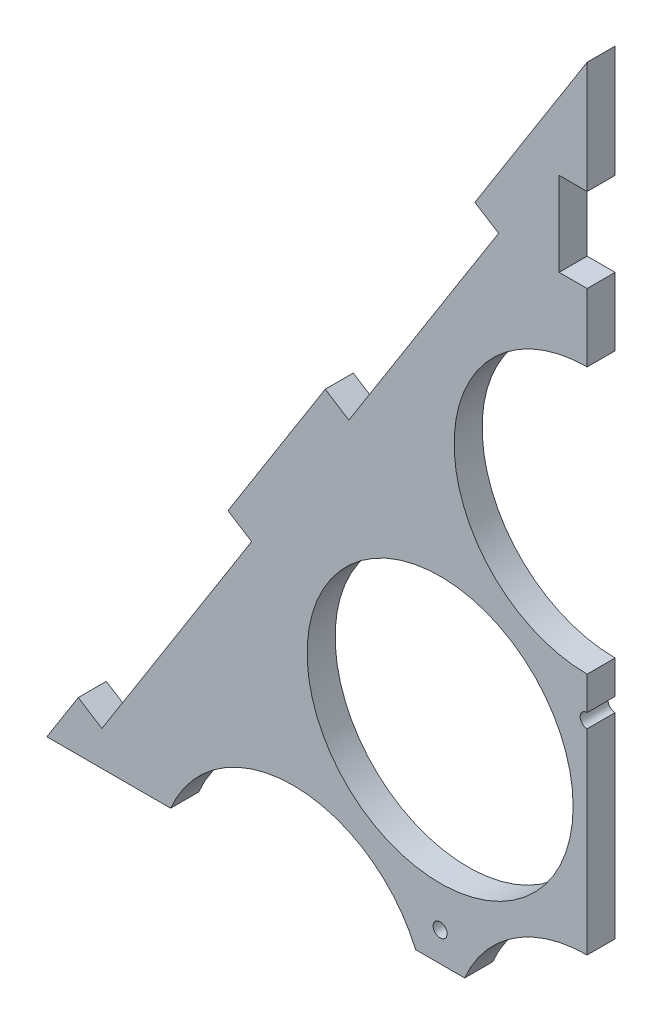
ISO-10303-21;
HEADER;
FILE_DESCRIPTION(('STEP AP214'),'2;1');
FILE_NAME('part.step','',(''),(''),'','','');
FILE_SCHEMA(('AUTOMOTIVE_DESIGN { 1 0 10303 214 1 1 1 1 }'));
ENDSEC;
DATA;
#1=APPLICATION_CONTEXT('core data for automotive mechanical design processes');
#2=APPLICATION_PROTOCOL_DEFINITION('international standard','automotive_design',2000,#1);
#3=PRODUCT_CONTEXT('',#1,'mechanical');
#4=PRODUCT('Part','Part','',(#3));
#5=PRODUCT_RELATED_PRODUCT_CATEGORY('part','',(#4));
#6=PRODUCT_DEFINITION_FORMATION('','',#4);
#7=PRODUCT_DEFINITION_CONTEXT('part definition',#1,'design');
#8=PRODUCT_DEFINITION('design','',#6,#7);
#9=PRODUCT_DEFINITION_SHAPE('','',#8);
#10=(LENGTH_UNIT() NAMED_UNIT(*) SI_UNIT(.MILLI.,.METRE.));
#11=(NAMED_UNIT(*) PLANE_ANGLE_UNIT() SI_UNIT($,.RADIAN.));
#12=(NAMED_UNIT(*) SI_UNIT($,.STERADIAN.) SOLID_ANGLE_UNIT());
#13=UNCERTAINTY_MEASURE_WITH_UNIT(LENGTH_MEASURE(1.E-05),#10,'distance_accuracy_value','');
#14=(GEOMETRIC_REPRESENTATION_CONTEXT(3) GLOBAL_UNCERTAINTY_ASSIGNED_CONTEXT((#13)) GLOBAL_UNIT_ASSIGNED_CONTEXT((#10,
#11,#12)) REPRESENTATION_CONTEXT('',''));
#15=CARTESIAN_POINT('',(0.,0.,0.));
#16=DIRECTION('',(0.,0.,1.));
#17=DIRECTION('',(1.,0.,0.));
#18=AXIS2_PLACEMENT_3D('',#15,#16,#17);
#19=CARTESIAN_POINT('',(0.,414.561180134828,0.));
#20=DIRECTION('',(-1.,0.,0.));
#21=DIRECTION('',(0.,-1.,0.));
#22=AXIS2_PLACEMENT_3D('',#19,#20,#21);
#23=PLANE('',#22);
#24=DIRECTION('',(0.,-1.,0.));
#25=VECTOR('',#24,1.);
#26=CARTESIAN_POINT('',(0.,414.561180134828,0.));
#27=LINE('',#26,#25);
#28=CARTESIAN_POINT('',(0.,344.561180134828,0.));
#29=VERTEX_POINT('',#28);
#30=CARTESIAN_POINT('',(0.,320.298002192098,0.));
#31=VERTEX_POINT('',#30);
#32=EDGE_CURVE('E220',#29,#31,#27,.T.);
#33=ORIENTED_EDGE('',*,*,#32,.F.);
#34=DIRECTION('',(0.,0.,1.));
#35=VECTOR('',#34,1.);
#36=CARTESIAN_POINT('',(0.,344.561180134828,0.));
#37=LINE('',#36,#35);
#38=CARTESIAN_POINT('',(0.,344.561180134828,10.));
#39=VERTEX_POINT('',#38);
#40=EDGE_CURVE('E213',#29,#39,#37,.T.);
#41=ORIENTED_EDGE('',*,*,#40,.T.);
#42=DIRECTION('',(0.,-1.,0.));
#43=VECTOR('',#42,1.);
#44=CARTESIAN_POINT('',(0.,414.561180134828,10.));
#45=LINE('',#44,#43);
#46=CARTESIAN_POINT('',(0.,320.298002192098,10.));
#47=VERTEX_POINT('',#46);
#48=EDGE_CURVE('E228',#39,#47,#45,.T.);
#49=ORIENTED_EDGE('',*,*,#48,.T.);
#50=DIRECTION('',(0.,0.,-1.));
#51=VECTOR('',#50,1.);
#52=CARTESIAN_POINT('',(0.,320.298002192098,10.));
#53=LINE('',#52,#51);
#54=EDGE_CURVE('E234',#47,#31,#53,.T.);
#55=ORIENTED_EDGE('',*,*,#54,.T.);
#56=EDGE_LOOP('',(#33,#41,#49,#55));
#57=FACE_BOUND('',#56,.T.);
#58=ADVANCED_FACE('F35',(#57),#23,.F.);
#59=CARTESIAN_POINT('',(-310.,-75.6428590162172,10.));
#60=DIRECTION('',(0.845179377846631,-0.53448275862069,0.));
#61=DIRECTION('',(0.53448275862069,0.845179377846631,0.));
#62=AXIS2_PLACEMENT_3D('',#59,#60,#61);
#63=PLANE('',#62);
#64=DIRECTION('',(-0.53448275862069,-0.845179377846631,0.));
#65=VECTOR('',#64,1.);
#66=CARTESIAN_POINT('',(-310.,-75.6428590162172,0.));
#67=LINE('',#66,#65);
#68=CARTESIAN_POINT('',(-181.724137931035,127.200191666973,0.));
#69=VERTEX_POINT('',#68);
#70=CARTESIAN_POINT('',(-192.942106645631,109.461180134828,0.));
#71=VERTEX_POINT('',#70);
#72=EDGE_CURVE('E332',#69,#71,#67,.T.);
#73=ORIENTED_EDGE('',*,*,#72,.T.);
#74=DIRECTION('',(0.,0.,1.));
#75=VECTOR('',#74,1.);
#76=CARTESIAN_POINT('',(-192.942106645631,109.461180134828,10.));
#77=LINE('',#76,#75);
#78=CARTESIAN_POINT('',(-192.942106645631,109.461180134828,10.));
#79=VERTEX_POINT('',#78);
#80=EDGE_CURVE('E243',#71,#79,#77,.T.);
#81=ORIENTED_EDGE('',*,*,#80,.T.);
#82=DIRECTION('',(-0.53448275862069,-0.845179377846631,0.));
#83=VECTOR('',#82,1.);
#84=CARTESIAN_POINT('',(-310.,-75.6428590162172,10.));
#85=LINE('',#84,#83);
#86=CARTESIAN_POINT('',(-181.724137931035,127.200191666974,10.));
#87=VERTEX_POINT('',#86);
#88=EDGE_CURVE('E340',#87,#79,#85,.T.);
#89=ORIENTED_EDGE('',*,*,#88,.F.);
#90=DIRECTION('',(0.,0.,1.));
#91=VECTOR('',#90,1.);
#92=CARTESIAN_POINT('',(-181.724137931035,127.200191666974,0.));
#93=LINE('',#92,#91);
#94=EDGE_CURVE('E269',#69,#87,#93,.T.);
#95=ORIENTED_EDGE('',*,*,#94,.F.);
#96=EDGE_LOOP('',(#73,#81,#89,#95));
#97=FACE_BOUND('',#96,.T.);
#98=ADVANCED_FACE('F37',(#97),#63,.F.);
#99=CARTESIAN_POINT('',(-93.5344827586213,266.654789011667,0.));
#100=VERTEX_POINT('',#99);
#101=CARTESIAN_POINT('',(-128.275862068965,211.718129451637,0.));
#102=VERTEX_POINT('',#101);
#103=EDGE_CURVE('E344',#100,#102,#67,.T.);
#104=ORIENTED_EDGE('',*,*,#103,.T.);
#105=DIRECTION('',(0.,0.,1.));
#106=VECTOR('',#105,1.);
#107=CARTESIAN_POINT('',(-128.275862068965,211.718129451637,0.));
#108=LINE('',#107,#106);
#109=CARTESIAN_POINT('',(-128.275862068965,211.718129451637,10.));
#110=VERTEX_POINT('',#109);
#111=EDGE_CURVE('E278',#102,#110,#108,.T.);
#112=ORIENTED_EDGE('',*,*,#111,.T.);
#113=CARTESIAN_POINT('',(-93.5344827586214,266.654789011669,10.));
#114=VERTEX_POINT('',#113);
#115=EDGE_CURVE('E339',#114,#110,#85,.T.);
#116=ORIENTED_EDGE('',*,*,#115,.F.);
#117=DIRECTION('',(0.,0.,1.));
#118=VECTOR('',#117,1.);
#119=CARTESIAN_POINT('',(-93.5344827586214,266.654789011669,0.));
#120=LINE('',#119,#118);
#121=EDGE_CURVE('E297',#100,#114,#120,.T.);
#122=ORIENTED_EDGE('',*,*,#121,.F.);
#123=EDGE_LOOP('',(#104,#112,#116,#122));
#124=FACE_BOUND('',#123,.T.);
#125=ADVANCED_FACE('F391',(#124),#63,.F.);
#126=CARTESIAN_POINT('',(0.,414.561180134828,0.));
#127=VERTEX_POINT('',#126);
#128=CARTESIAN_POINT('',(-40.0862068965517,351.172726796331,0.));
#129=VERTEX_POINT('',#128);
#130=EDGE_CURVE('E341',#127,#129,#67,.T.);
#131=ORIENTED_EDGE('',*,*,#130,.T.);
#132=DIRECTION('',(0.,0.,1.));
#133=VECTOR('',#132,1.);
#134=CARTESIAN_POINT('',(-40.0862068965517,351.172726796331,0.));
#135=LINE('',#134,#133);
#136=CARTESIAN_POINT('',(-40.0862068965517,351.172726796331,10.));
#137=VERTEX_POINT('',#136);
#138=EDGE_CURVE('E274',#129,#137,#135,.T.);
#139=ORIENTED_EDGE('',*,*,#138,.T.);
#140=CARTESIAN_POINT('',(0.,414.561180134828,10.));
#141=VERTEX_POINT('',#140);
#142=EDGE_CURVE('E335',#141,#137,#85,.T.);
#143=ORIENTED_EDGE('',*,*,#142,.F.);
#144=DIRECTION('',(0.,0.,-1.));
#145=VECTOR('',#144,1.);
#146=CARTESIAN_POINT('',(0.,414.561180134828,10.));
#147=LINE('',#146,#145);
#148=EDGE_CURVE('E338',#141,#127,#147,.T.);
#149=ORIENTED_EDGE('',*,*,#148,.T.);
#150=EDGE_LOOP('',(#131,#139,#143,#149));
#151=FACE_BOUND('',#150,.T.);
#152=ADVANCED_FACE('F411',(#151),#63,.F.);
#153=CARTESIAN_POINT('',(0.,0.,10.));
#154=DIRECTION('',(0.,0.,-1.));
#155=DIRECTION('',(-1.,0.,0.));
#156=AXIS2_PLACEMENT_3D('',#153,#154,#155);
#157=PLANE('',#156);
#158=CARTESIAN_POINT('',(-52.5,119.980042493922,10.));
#159=DIRECTION('',(0.,0.,1.));
#160=DIRECTION('',(1.,0.,0.));
#161=AXIS2_PLACEMENT_3D('',#158,#159,#160);
#162=CIRCLE('',#161,2.5);
#163=CARTESIAN_POINT('',(-50.,119.980042493922,10.));
#164=VERTEX_POINT('',#163);
#165=EDGE_CURVE('E250',#164,#164,#162,.T.);
#166=ORIENTED_EDGE('',*,*,#165,.F.);
#167=EDGE_LOOP('',(#166));
#168=FACE_BOUND('',#167,.T.);
#169=ORIENTED_EDGE('',*,*,#48,.F.);
#170=DIRECTION('',(1.,0.,0.));
#171=VECTOR('',#170,1.);
#172=CARTESIAN_POINT('',(0.,344.561180134828,10.));
#173=LINE('',#172,#171);
#174=CARTESIAN_POINT('',(-10.,344.561180134828,10.));
#175=VERTEX_POINT('',#174);
#176=EDGE_CURVE('E205',#175,#39,#173,.T.);
#177=ORIENTED_EDGE('',*,*,#176,.F.);
#178=DIRECTION('',(0.,-1.,0.));
#179=VECTOR('',#178,1.);
#180=CARTESIAN_POINT('',(-10.,374.561180134828,10.));
#181=LINE('',#180,#179);
#182=CARTESIAN_POINT('',(-10.,374.561180134828,10.));
#183=VERTEX_POINT('',#182);
#184=EDGE_CURVE('E207',#183,#175,#181,.T.);
#185=ORIENTED_EDGE('',*,*,#184,.F.);
#186=DIRECTION('',(-1.,0.,0.));
#187=VECTOR('',#186,1.);
#188=CARTESIAN_POINT('',(0.,374.561180134828,10.));
#189=LINE('',#188,#187);
#190=CARTESIAN_POINT('',(0.,374.561180134828,10.));
#191=VERTEX_POINT('',#190);
#192=EDGE_CURVE('E185',#191,#183,#189,.T.);
#193=ORIENTED_EDGE('',*,*,#192,.F.);
#194=EDGE_CURVE('E224',#141,#191,#45,.T.);
#195=ORIENTED_EDGE('',*,*,#194,.F.);
#196=ORIENTED_EDGE('',*,*,#142,.T.);
#197=DIRECTION('',(-0.84517937784663,0.534482758620691,0.));
#198=VECTOR('',#197,1.);
#199=CARTESIAN_POINT('',(-31.6344131180852,345.827899210124,10.));
#200=LINE('',#199,#198);
#201=CARTESIAN_POINT('',(-31.6344131180852,345.827899210124,10.));
#202=VERTEX_POINT('',#201);
#203=EDGE_CURVE('E291',#202,#137,#200,.T.);
#204=ORIENTED_EDGE('',*,*,#203,.F.);
#205=DIRECTION('',(0.53448275862069,0.845179377846631,0.));
#206=VECTOR('',#205,1.);
#207=CARTESIAN_POINT('',(-85.0826889801541,261.309961425461,10.));
#208=LINE('',#207,#206);
#209=CARTESIAN_POINT('',(-85.0826889801541,261.309961425461,10.));
#210=VERTEX_POINT('',#209);
#211=EDGE_CURVE('E300',#210,#202,#208,.T.);
#212=ORIENTED_EDGE('',*,*,#211,.F.);
#213=DIRECTION('',(0.84517937784663,-0.534482758620691,0.));
#214=VECTOR('',#213,1.);
#215=CARTESIAN_POINT('',(-93.5344827586214,266.654789011669,10.));
#216=LINE('',#215,#214);
#217=EDGE_CURVE('E256',#114,#210,#216,.T.);
#218=ORIENTED_EDGE('',*,*,#217,.F.);
#219=ORIENTED_EDGE('',*,*,#115,.T.);
#220=DIRECTION('',(-0.84517937784663,0.53448275862069,0.));
#221=VECTOR('',#220,1.);
#222=CARTESIAN_POINT('',(-119.8240682905,206.37330186543,10.));
#223=LINE('',#222,#221);
#224=CARTESIAN_POINT('',(-119.8240682905,206.37330186543,10.));
#225=VERTEX_POINT('',#224);
#226=EDGE_CURVE('E263',#225,#110,#223,.T.);
#227=ORIENTED_EDGE('',*,*,#226,.F.);
#228=DIRECTION('',(0.534482758620691,0.845179377846629,0.));
#229=VECTOR('',#228,1.);
#230=CARTESIAN_POINT('',(-173.272344152569,121.855364080768,10.));
#231=LINE('',#230,#229);
#232=CARTESIAN_POINT('',(-173.272344152569,121.855364080768,10.));
#233=VERTEX_POINT('',#232);
#234=EDGE_CURVE('E273',#233,#225,#231,.T.);
#235=ORIENTED_EDGE('',*,*,#234,.F.);
#236=DIRECTION('',(0.84517937784663,-0.534482758620691,0.));
#237=VECTOR('',#236,1.);
#238=CARTESIAN_POINT('',(-181.724137931035,127.200191666974,10.));
#239=LINE('',#238,#237);
#240=EDGE_CURVE('E270',#87,#233,#239,.T.);
#241=ORIENTED_EDGE('',*,*,#240,.F.);
#242=ORIENTED_EDGE('',*,*,#88,.T.);
#243=DIRECTION('',(-1.,0.,0.));
#244=VECTOR('',#243,1.);
#245=CARTESIAN_POINT('',(0.,109.461180134828,10.));
#246=LINE('',#245,#244);
#247=CARTESIAN_POINT('',(-148.737217741161,109.461180134828,10.));
#248=VERTEX_POINT('',#247);
#249=EDGE_CURVE('E227',#248,#79,#246,.T.);
#250=ORIENTED_EDGE('',*,*,#249,.F.);
#251=CARTESIAN_POINT('',(-105.,90.932667397366,10.));
#252=DIRECTION('',(0.,0.,1.));
#253=DIRECTION('',(1.,0.,0.));
#254=AXIS2_PLACEMENT_3D('',#251,#252,#253);
#255=CIRCLE('',#254,47.5);
#256=CARTESIAN_POINT('',(-61.2627822588393,109.461180134828,10.));
#257=VERTEX_POINT('',#256);
#258=EDGE_CURVE('E329',#257,#248,#255,.T.);
#259=ORIENTED_EDGE('',*,*,#258,.F.);
#260=CARTESIAN_POINT('',(-43.7372177411607,109.461180134828,10.));
#261=VERTEX_POINT('',#260);
#262=EDGE_CURVE('E231',#261,#257,#246,.T.);
#263=ORIENTED_EDGE('',*,*,#262,.F.);
#264=CARTESIAN_POINT('',(0.,90.932667397366,10.));
#265=DIRECTION('',(0.,0.,1.));
#266=DIRECTION('',(1.,0.,0.));
#267=AXIS2_PLACEMENT_3D('',#264,#265,#266);
#268=CIRCLE('',#267,47.5);
#269=CARTESIAN_POINT('',(0.,138.432667397366,10.));
#270=VERTEX_POINT('',#269);
#271=EDGE_CURVE('E323',#270,#261,#268,.T.);
#272=ORIENTED_EDGE('',*,*,#271,.F.);
#273=CARTESIAN_POINT('',(0.,208.412709891288,10.));
#274=VERTEX_POINT('',#273);
#275=EDGE_CURVE('E216',#274,#270,#45,.T.);
#276=ORIENTED_EDGE('',*,*,#275,.F.);
#277=CARTESIAN_POINT('',(0.,210.912709891288,10.));
#278=DIRECTION('',(0.,0.,1.));
#279=DIRECTION('',(1.,0.,0.));
#280=AXIS2_PLACEMENT_3D('',#277,#278,#279);
#281=CIRCLE('',#280,2.5);
#282=CARTESIAN_POINT('',(0.,213.412709891288,10.));
#283=VERTEX_POINT('',#282);
#284=EDGE_CURVE('E246',#283,#274,#281,.T.);
#285=ORIENTED_EDGE('',*,*,#284,.F.);
#286=CARTESIAN_POINT('',(0.,225.298002192098,10.));
#287=VERTEX_POINT('',#286);
#288=EDGE_CURVE('E229',#287,#283,#45,.T.);
#289=ORIENTED_EDGE('',*,*,#288,.F.);
#290=CARTESIAN_POINT('',(0.,272.798002192098,10.));
#291=DIRECTION('',(0.,0.,1.));
#292=DIRECTION('',(1.,0.,0.));
#293=AXIS2_PLACEMENT_3D('',#290,#291,#292);
#294=CIRCLE('',#293,47.5);
#295=EDGE_CURVE('E311',#47,#287,#294,.T.);
#296=ORIENTED_EDGE('',*,*,#295,.F.);
#297=EDGE_LOOP('',(#169,#177,#185,#193,#195,#196,#204,#212,#218,#219,#227,#235,#241,#242,#250,
#259,#263,#272,#276,#285,#289,#296));
#298=FACE_BOUND('',#297,.T.);
#299=CARTESIAN_POINT('',(-52.5,181.865334794732,10.));
#300=DIRECTION('',(0.,0.,1.));
#301=DIRECTION('',(1.,0.,0.));
#302=AXIS2_PLACEMENT_3D('',#299,#300,#301);
#303=CIRCLE('',#302,47.5);
#304=CARTESIAN_POINT('',(-4.99999999999998,181.865334794732,10.));
#305=VERTEX_POINT('',#304);
#306=EDGE_CURVE('E317',#305,#305,#303,.T.);
#307=ORIENTED_EDGE('',*,*,#306,.F.);
#308=EDGE_LOOP('',(#307));
#309=FACE_BOUND('',#308,.T.);
#310=ADVANCED_FACE('F377',(#168,#298,#309),#157,.F.);
#311=CARTESIAN_POINT('',(0.,0.,0.));
#312=DIRECTION('',(0.,0.,-1.));
#313=DIRECTION('',(-1.,0.,0.));
#314=AXIS2_PLACEMENT_3D('',#311,#312,#313);
#315=PLANE('',#314);
#316=DIRECTION('',(1.,0.,0.));
#317=VECTOR('',#316,1.);
#318=CARTESIAN_POINT('',(0.,344.561180134828,0.));
#319=LINE('',#318,#317);
#320=CARTESIAN_POINT('',(-10.,344.561180134828,0.));
#321=VERTEX_POINT('',#320);
#322=EDGE_CURVE('E198',#321,#29,#319,.T.);
#323=ORIENTED_EDGE('',*,*,#322,.T.);
#324=ORIENTED_EDGE('',*,*,#32,.T.);
#325=CARTESIAN_POINT('',(0.,272.798002192098,0.));
#326=DIRECTION('',(0.,0.,1.));
#327=DIRECTION('',(1.,0.,0.));
#328=AXIS2_PLACEMENT_3D('',#325,#326,#327);
#329=CIRCLE('',#328,47.5);
#330=CARTESIAN_POINT('',(0.,225.298002192098,0.));
#331=VERTEX_POINT('',#330);
#332=EDGE_CURVE('E281',#31,#331,#329,.T.);
#333=ORIENTED_EDGE('',*,*,#332,.T.);
#334=CARTESIAN_POINT('',(0.,213.412709891288,0.));
#335=VERTEX_POINT('',#334);
#336=EDGE_CURVE('E221',#331,#335,#27,.T.);
#337=ORIENTED_EDGE('',*,*,#336,.T.);
#338=CARTESIAN_POINT('',(0.,210.912709891288,0.));
#339=DIRECTION('',(0.,0.,1.));
#340=DIRECTION('',(1.,0.,0.));
#341=AXIS2_PLACEMENT_3D('',#338,#339,#340);
#342=CIRCLE('',#341,2.5);
#343=CARTESIAN_POINT('',(0.,208.412709891288,0.));
#344=VERTEX_POINT('',#343);
#345=EDGE_CURVE('E247',#335,#344,#342,.T.);
#346=ORIENTED_EDGE('',*,*,#345,.T.);
#347=CARTESIAN_POINT('',(0.,138.432667397366,0.));
#348=VERTEX_POINT('',#347);
#349=EDGE_CURVE('E358',#344,#348,#27,.T.);
#350=ORIENTED_EDGE('',*,*,#349,.T.);
#351=CARTESIAN_POINT('',(0.,90.932667397366,0.));
#352=DIRECTION('',(0.,0.,1.));
#353=DIRECTION('',(1.,0.,0.));
#354=AXIS2_PLACEMENT_3D('',#351,#352,#353);
#355=CIRCLE('',#354,47.5);
#356=CARTESIAN_POINT('',(-43.7372177411607,109.461180134828,0.));
#357=VERTEX_POINT('',#356);
#358=EDGE_CURVE('E320',#348,#357,#355,.T.);
#359=ORIENTED_EDGE('',*,*,#358,.T.);
#360=DIRECTION('',(-1.,0.,0.));
#361=VECTOR('',#360,1.);
#362=CARTESIAN_POINT('',(0.,109.461180134828,0.));
#363=LINE('',#362,#361);
#364=CARTESIAN_POINT('',(-61.2627822588393,109.461180134828,0.));
#365=VERTEX_POINT('',#364);
#366=EDGE_CURVE('E223',#357,#365,#363,.T.);
#367=ORIENTED_EDGE('',*,*,#366,.T.);
#368=CARTESIAN_POINT('',(-105.,90.932667397366,0.));
#369=DIRECTION('',(0.,0.,1.));
#370=DIRECTION('',(1.,0.,0.));
#371=AXIS2_PLACEMENT_3D('',#368,#369,#370);
#372=CIRCLE('',#371,47.5);
#373=CARTESIAN_POINT('',(-148.737217741161,109.461180134828,0.));
#374=VERTEX_POINT('',#373);
#375=EDGE_CURVE('E326',#365,#374,#372,.T.);
#376=ORIENTED_EDGE('',*,*,#375,.T.);
#377=EDGE_CURVE('E58',#374,#71,#363,.T.);
#378=ORIENTED_EDGE('',*,*,#377,.T.);
#379=ORIENTED_EDGE('',*,*,#72,.F.);
#380=DIRECTION('',(0.84517937784663,-0.534482758620691,0.));
#381=VECTOR('',#380,1.);
#382=CARTESIAN_POINT('',(-181.724137931035,127.200191666974,0.));
#383=LINE('',#382,#381);
#384=CARTESIAN_POINT('',(-173.272344152569,121.855364080768,0.));
#385=VERTEX_POINT('',#384);
#386=EDGE_CURVE('E259',#69,#385,#383,.T.);
#387=ORIENTED_EDGE('',*,*,#386,.T.);
#388=DIRECTION('',(0.534482758620691,0.845179377846629,0.));
#389=VECTOR('',#388,1.);
#390=CARTESIAN_POINT('',(-173.272344152569,121.855364080768,0.));
#391=LINE('',#390,#389);
#392=CARTESIAN_POINT('',(-119.8240682905,206.37330186543,0.));
#393=VERTEX_POINT('',#392);
#394=EDGE_CURVE('E262',#385,#393,#391,.T.);
#395=ORIENTED_EDGE('',*,*,#394,.T.);
#396=DIRECTION('',(-0.84517937784663,0.53448275862069,0.));
#397=VECTOR('',#396,1.);
#398=CARTESIAN_POINT('',(-119.8240682905,206.37330186543,0.));
#399=LINE('',#398,#397);
#400=EDGE_CURVE('E266',#393,#102,#399,.T.);
#401=ORIENTED_EDGE('',*,*,#400,.T.);
#402=ORIENTED_EDGE('',*,*,#103,.F.);
#403=DIRECTION('',(0.84517937784663,-0.534482758620691,0.));
#404=VECTOR('',#403,1.);
#405=CARTESIAN_POINT('',(-93.5344827586214,266.654789011669,0.));
#406=LINE('',#405,#404);
#407=CARTESIAN_POINT('',(-85.0826889801541,261.309961425461,0.));
#408=VERTEX_POINT('',#407);
#409=EDGE_CURVE('E287',#100,#408,#406,.T.);
#410=ORIENTED_EDGE('',*,*,#409,.T.);
#411=DIRECTION('',(0.53448275862069,0.845179377846631,0.));
#412=VECTOR('',#411,1.);
#413=CARTESIAN_POINT('',(-85.0826889801541,261.309961425461,0.));
#414=LINE('',#413,#412);
#415=CARTESIAN_POINT('',(-31.6344131180852,345.827899210124,0.));
#416=VERTEX_POINT('',#415);
#417=EDGE_CURVE('E290',#408,#416,#414,.T.);
#418=ORIENTED_EDGE('',*,*,#417,.T.);
#419=DIRECTION('',(-0.84517937784663,0.534482758620691,0.));
#420=VECTOR('',#419,1.);
#421=CARTESIAN_POINT('',(-31.6344131180852,345.827899210124,0.));
#422=LINE('',#421,#420);
#423=EDGE_CURVE('E294',#416,#129,#422,.T.);
#424=ORIENTED_EDGE('',*,*,#423,.T.);
#425=ORIENTED_EDGE('',*,*,#130,.F.);
#426=CARTESIAN_POINT('',(0.,374.561180134828,0.));
#427=VERTEX_POINT('',#426);
#428=EDGE_CURVE('E204',#127,#427,#27,.T.);
#429=ORIENTED_EDGE('',*,*,#428,.T.);
#430=DIRECTION('',(-1.,0.,0.));
#431=VECTOR('',#430,1.);
#432=CARTESIAN_POINT('',(0.,374.561180134828,0.));
#433=LINE('',#432,#431);
#434=CARTESIAN_POINT('',(-10.,374.561180134828,0.));
#435=VERTEX_POINT('',#434);
#436=EDGE_CURVE('E50',#427,#435,#433,.T.);
#437=ORIENTED_EDGE('',*,*,#436,.T.);
#438=DIRECTION('',(0.,-1.,0.));
#439=VECTOR('',#438,1.);
#440=CARTESIAN_POINT('',(-10.,374.561180134828,0.));
#441=LINE('',#440,#439);
#442=EDGE_CURVE('E193',#435,#321,#441,.T.);
#443=ORIENTED_EDGE('',*,*,#442,.T.);
#444=EDGE_LOOP('',(#323,#324,#333,#337,#346,#350,#359,#367,#376,#378,#379,#387,#395,#401,#402,
#410,#418,#424,#425,#429,#437,#443));
#445=FACE_BOUND('',#444,.T.);
#446=CARTESIAN_POINT('',(-52.5,119.980042493922,0.));
#447=DIRECTION('',(0.,0.,1.));
#448=DIRECTION('',(1.,0.,0.));
#449=AXIS2_PLACEMENT_3D('',#446,#447,#448);
#450=CIRCLE('',#449,2.5);
#451=CARTESIAN_POINT('',(-50.,119.980042493922,0.));
#452=VERTEX_POINT('',#451);
#453=EDGE_CURVE('E253',#452,#452,#450,.T.);
#454=ORIENTED_EDGE('',*,*,#453,.T.);
#455=EDGE_LOOP('',(#454));
#456=FACE_BOUND('',#455,.T.);
#457=CARTESIAN_POINT('',(-52.5,181.865334794732,0.));
#458=DIRECTION('',(0.,0.,1.));
#459=DIRECTION('',(1.,0.,0.));
#460=AXIS2_PLACEMENT_3D('',#457,#458,#459);
#461=CIRCLE('',#460,47.5);
#462=CARTESIAN_POINT('',(-4.99999999999998,181.865334794732,0.));
#463=VERTEX_POINT('',#462);
#464=EDGE_CURVE('E314',#463,#463,#461,.T.);
#465=ORIENTED_EDGE('',*,*,#464,.T.);
#466=EDGE_LOOP('',(#465));
#467=FACE_BOUND('',#466,.T.);
#468=ADVANCED_FACE('F201',(#445,#456,#467),#315,.T.);
#469=CARTESIAN_POINT('',(-105.,90.932667397366,10.));
#470=DIRECTION('',(0.,0.,-1.));
#471=DIRECTION('',(-1.,0.,0.));
#472=AXIS2_PLACEMENT_3D('',#469,#470,#471);
#473=CYLINDRICAL_SURFACE('',#472,47.5);
#474=DIRECTION('',(0.,0.,-1.));
#475=VECTOR('',#474,1.);
#476=CARTESIAN_POINT('',(-61.2627822588393,109.461180134828,10.));
#477=LINE('',#476,#475);
#478=EDGE_CURVE('E241',#257,#365,#477,.T.);
#479=ORIENTED_EDGE('',*,*,#478,.F.);
#480=ORIENTED_EDGE('',*,*,#258,.T.);
#481=DIRECTION('',(0.,0.,-1.));
#482=VECTOR('',#481,1.);
#483=CARTESIAN_POINT('',(-148.737217741161,109.461180134828,10.));
#484=LINE('',#483,#482);
#485=EDGE_CURVE('E239',#374,#248,#484,.F.);
#486=ORIENTED_EDGE('',*,*,#485,.F.);
#487=ORIENTED_EDGE('',*,*,#375,.F.);
#488=EDGE_LOOP('',(#479,#480,#486,#487));
#489=FACE_BOUND('',#488,.T.);
#490=ADVANCED_FACE('F374',(#489),#473,.F.);
#491=CARTESIAN_POINT('',(0.,90.932667397366,10.));
#492=DIRECTION('',(0.,0.,-1.));
#493=DIRECTION('',(-1.,0.,0.));
#494=AXIS2_PLACEMENT_3D('',#491,#492,#493);
#495=CYLINDRICAL_SURFACE('',#494,47.5);
#496=DIRECTION('',(0.,0.,-1.));
#497=VECTOR('',#496,1.);
#498=CARTESIAN_POINT('',(-43.7372177411607,109.461180134828,10.));
#499=LINE('',#498,#497);
#500=EDGE_CURVE('E11',#357,#261,#499,.F.);
#501=ORIENTED_EDGE('',*,*,#500,.F.);
#502=ORIENTED_EDGE('',*,*,#358,.F.);
#503=DIRECTION('',(0.,0.,-1.));
#504=VECTOR('',#503,1.);
#505=CARTESIAN_POINT('',(0.,138.432667397366,10.));
#506=LINE('',#505,#504);
#507=EDGE_CURVE('E237',#270,#348,#506,.T.);
#508=ORIENTED_EDGE('',*,*,#507,.F.);
#509=ORIENTED_EDGE('',*,*,#271,.T.);
#510=EDGE_LOOP('',(#501,#502,#508,#509));
#511=FACE_BOUND('',#510,.T.);
#512=ADVANCED_FACE('F430',(#511),#495,.F.);
#513=CARTESIAN_POINT('',(-52.5,181.865334794732,10.));
#514=DIRECTION('',(0.,0.,-1.));
#515=DIRECTION('',(-1.,0.,0.));
#516=AXIS2_PLACEMENT_3D('',#513,#514,#515);
#517=CYLINDRICAL_SURFACE('',#516,47.5);
#518=ORIENTED_EDGE('',*,*,#306,.T.);
#519=EDGE_LOOP('',(#518));
#520=FACE_BOUND('',#519,.T.);
#521=ORIENTED_EDGE('',*,*,#464,.F.);
#522=EDGE_LOOP('',(#521));
#523=FACE_BOUND('',#522,.T.);
#524=ADVANCED_FACE('F432',(#520,#523),#517,.F.);
#525=CARTESIAN_POINT('',(0.,272.798002192098,10.));
#526=DIRECTION('',(0.,0.,-1.));
#527=DIRECTION('',(-1.,0.,0.));
#528=AXIS2_PLACEMENT_3D('',#525,#526,#527);
#529=CYLINDRICAL_SURFACE('',#528,47.5);
#530=ORIENTED_EDGE('',*,*,#54,.F.);
#531=ORIENTED_EDGE('',*,*,#295,.T.);
#532=DIRECTION('',(0.,0.,-1.));
#533=VECTOR('',#532,1.);
#534=CARTESIAN_POINT('',(0.,225.298002192098,10.));
#535=LINE('',#534,#533);
#536=EDGE_CURVE('E232',#331,#287,#535,.F.);
#537=ORIENTED_EDGE('',*,*,#536,.F.);
#538=ORIENTED_EDGE('',*,*,#332,.F.);
#539=EDGE_LOOP('',(#530,#531,#537,#538));
#540=FACE_BOUND('',#539,.T.);
#541=ADVANCED_FACE('F424',(#540),#529,.F.);
#542=CARTESIAN_POINT('',(-31.6344131180852,345.827899210124,0.));
#543=DIRECTION('',(0.534482758620691,0.84517937784663,0.));
#544=DIRECTION('',(-0.84517937784663,0.534482758620691,0.));
#545=AXIS2_PLACEMENT_3D('',#542,#543,#544);
#546=PLANE('',#545);
#547=ORIENTED_EDGE('',*,*,#203,.T.);
#548=ORIENTED_EDGE('',*,*,#138,.F.);
#549=ORIENTED_EDGE('',*,*,#423,.F.);
#550=DIRECTION('',(0.,0.,1.));
#551=VECTOR('',#550,1.);
#552=CARTESIAN_POINT('',(-31.6344131180852,345.827899210124,0.));
#553=LINE('',#552,#551);
#554=EDGE_CURVE('E306',#416,#202,#553,.T.);
#555=ORIENTED_EDGE('',*,*,#554,.T.);
#556=EDGE_LOOP('',(#547,#548,#549,#555));
#557=FACE_BOUND('',#556,.T.);
#558=ADVANCED_FACE('F475',(#557),#546,.F.);
#559=CARTESIAN_POINT('',(-85.0826889801541,261.309961425461,0.));
#560=DIRECTION('',(0.845179377846631,-0.53448275862069,0.));
#561=DIRECTION('',(0.53448275862069,0.845179377846631,0.));
#562=AXIS2_PLACEMENT_3D('',#559,#560,#561);
#563=PLANE('',#562);
#564=ORIENTED_EDGE('',*,*,#211,.T.);
#565=ORIENTED_EDGE('',*,*,#554,.F.);
#566=ORIENTED_EDGE('',*,*,#417,.F.);
#567=DIRECTION('',(0.,0.,1.));
#568=VECTOR('',#567,1.);
#569=CARTESIAN_POINT('',(-85.0826889801541,261.309961425461,0.));
#570=LINE('',#569,#568);
#571=EDGE_CURVE('E308',#408,#210,#570,.T.);
#572=ORIENTED_EDGE('',*,*,#571,.T.);
#573=EDGE_LOOP('',(#564,#565,#566,#572));
#574=FACE_BOUND('',#573,.T.);
#575=ADVANCED_FACE('F407',(#574),#563,.F.);
#576=CARTESIAN_POINT('',(-93.5344827586214,266.654789011669,0.));
#577=DIRECTION('',(-0.534482758620691,-0.84517937784663,0.));
#578=DIRECTION('',(0.84517937784663,-0.534482758620691,0.));
#579=AXIS2_PLACEMENT_3D('',#576,#577,#578);
#580=PLANE('',#579);
#581=ORIENTED_EDGE('',*,*,#217,.T.);
#582=ORIENTED_EDGE('',*,*,#571,.F.);
#583=ORIENTED_EDGE('',*,*,#409,.F.);
#584=ORIENTED_EDGE('',*,*,#121,.T.);
#585=EDGE_LOOP('',(#581,#582,#583,#584));
#586=FACE_BOUND('',#585,.T.);
#587=ADVANCED_FACE('F404',(#586),#580,.F.);
#588=CARTESIAN_POINT('',(-119.8240682905,206.37330186543,0.));
#589=DIRECTION('',(0.53448275862069,0.84517937784663,0.));
#590=DIRECTION('',(-0.845179377846631,0.53448275862069,0.));
#591=AXIS2_PLACEMENT_3D('',#588,#589,#590);
#592=PLANE('',#591);
#593=ORIENTED_EDGE('',*,*,#226,.T.);
#594=ORIENTED_EDGE('',*,*,#111,.F.);
#595=ORIENTED_EDGE('',*,*,#400,.F.);
#596=DIRECTION('',(0.,0.,1.));
#597=VECTOR('',#596,1.);
#598=CARTESIAN_POINT('',(-119.8240682905,206.37330186543,0.));
#599=LINE('',#598,#597);
#600=EDGE_CURVE('E282',#393,#225,#599,.T.);
#601=ORIENTED_EDGE('',*,*,#600,.T.);
#602=EDGE_LOOP('',(#593,#594,#595,#601));
#603=FACE_BOUND('',#602,.T.);
#604=ADVANCED_FACE('F397',(#603),#592,.F.);
#605=CARTESIAN_POINT('',(-173.272344152569,121.855364080768,0.));
#606=DIRECTION('',(0.845179377846629,-0.534482758620691,0.));
#607=DIRECTION('',(0.534482758620692,0.84517937784663,0.));
#608=AXIS2_PLACEMENT_3D('',#605,#606,#607);
#609=PLANE('',#608);
#610=ORIENTED_EDGE('',*,*,#234,.T.);
#611=ORIENTED_EDGE('',*,*,#600,.F.);
#612=ORIENTED_EDGE('',*,*,#394,.F.);
#613=DIRECTION('',(0.,0.,1.));
#614=VECTOR('',#613,1.);
#615=CARTESIAN_POINT('',(-173.272344152569,121.855364080768,0.));
#616=LINE('',#615,#614);
#617=EDGE_CURVE('E284',#385,#233,#616,.T.);
#618=ORIENTED_EDGE('',*,*,#617,.T.);
#619=EDGE_LOOP('',(#610,#611,#612,#618));
#620=FACE_BOUND('',#619,.T.);
#621=ADVANCED_FACE('F468',(#620),#609,.F.);
#622=CARTESIAN_POINT('',(-181.724137931035,127.200191666974,0.));
#623=DIRECTION('',(-0.534482758620691,-0.84517937784663,0.));
#624=DIRECTION('',(0.84517937784663,-0.534482758620691,0.));
#625=AXIS2_PLACEMENT_3D('',#622,#623,#624);
#626=PLANE('',#625);
#627=ORIENTED_EDGE('',*,*,#240,.T.);
#628=ORIENTED_EDGE('',*,*,#617,.F.);
#629=ORIENTED_EDGE('',*,*,#386,.F.);
#630=ORIENTED_EDGE('',*,*,#94,.T.);
#631=EDGE_LOOP('',(#627,#628,#629,#630));
#632=FACE_BOUND('',#631,.T.);
#633=ADVANCED_FACE('F462',(#632),#626,.F.);
#634=CARTESIAN_POINT('',(-52.5,119.980042493922,0.));
#635=DIRECTION('',(0.,0.,1.));
#636=DIRECTION('',(1.,0.,0.));
#637=AXIS2_PLACEMENT_3D('',#634,#635,#636);
#638=CYLINDRICAL_SURFACE('',#637,2.5);
#639=ORIENTED_EDGE('',*,*,#453,.F.);
#640=EDGE_LOOP('',(#639));
#641=FACE_BOUND('',#640,.T.);
#642=ORIENTED_EDGE('',*,*,#165,.T.);
#643=EDGE_LOOP('',(#642));
#644=FACE_BOUND('',#643,.T.);
#645=ADVANCED_FACE('F459',(#641,#644),#638,.F.);
#646=CARTESIAN_POINT('',(0.,210.912709891288,0.));
#647=DIRECTION('',(0.,0.,1.));
#648=DIRECTION('',(1.,0.,0.));
#649=AXIS2_PLACEMENT_3D('',#646,#647,#648);
#650=CYLINDRICAL_SURFACE('',#649,2.5);
#651=ORIENTED_EDGE('',*,*,#284,.T.);
#652=DIRECTION('',(0.,0.,1.));
#653=VECTOR('',#652,1.);
#654=CARTESIAN_POINT('',(0.,208.412709891288,0.));
#655=LINE('',#654,#653);
#656=EDGE_CURVE('E43',#274,#344,#655,.F.);
#657=ORIENTED_EDGE('',*,*,#656,.T.);
#658=ORIENTED_EDGE('',*,*,#345,.F.);
#659=DIRECTION('',(0.,0.,1.));
#660=VECTOR('',#659,1.);
#661=CARTESIAN_POINT('',(0.,213.412709891288,0.));
#662=LINE('',#661,#660);
#663=EDGE_CURVE('E347',#335,#283,#662,.T.);
#664=ORIENTED_EDGE('',*,*,#663,.T.);
#665=EDGE_LOOP('',(#651,#657,#658,#664));
#666=FACE_BOUND('',#665,.T.);
#667=ADVANCED_FACE('F352',(#666),#650,.F.);
#668=ORIENTED_EDGE('',*,*,#536,.T.);
#669=ORIENTED_EDGE('',*,*,#288,.T.);
#670=ORIENTED_EDGE('',*,*,#663,.F.);
#671=ORIENTED_EDGE('',*,*,#336,.F.);
#672=EDGE_LOOP('',(#668,#669,#670,#671));
#673=FACE_BOUND('',#672,.T.);
#674=ADVANCED_FACE('F426',(#673),#23,.F.);
#675=ORIENTED_EDGE('',*,*,#507,.T.);
#676=ORIENTED_EDGE('',*,*,#349,.F.);
#677=ORIENTED_EDGE('',*,*,#656,.F.);
#678=ORIENTED_EDGE('',*,*,#275,.T.);
#679=EDGE_LOOP('',(#675,#676,#677,#678));
#680=FACE_BOUND('',#679,.T.);
#681=ADVANCED_FACE('F428',(#680),#23,.F.);
#682=ORIENTED_EDGE('',*,*,#194,.T.);
#683=DIRECTION('',(0.,0.,1.));
#684=VECTOR('',#683,1.);
#685=CARTESIAN_POINT('',(0.,374.561180134828,0.));
#686=LINE('',#685,#684);
#687=EDGE_CURVE('E190',#427,#191,#686,.T.);
#688=ORIENTED_EDGE('',*,*,#687,.F.);
#689=ORIENTED_EDGE('',*,*,#428,.F.);
#690=ORIENTED_EDGE('',*,*,#148,.F.);
#691=EDGE_LOOP('',(#682,#688,#689,#690));
#692=FACE_BOUND('',#691,.T.);
#693=ADVANCED_FACE('F415',(#692),#23,.F.);
#694=CARTESIAN_POINT('',(0.,109.461180134828,0.));
#695=DIRECTION('',(0.,1.,0.));
#696=DIRECTION('',(-1.,0.,0.));
#697=AXIS2_PLACEMENT_3D('',#694,#695,#696);
#698=PLANE('',#697);
#699=ORIENTED_EDGE('',*,*,#478,.T.);
#700=ORIENTED_EDGE('',*,*,#366,.F.);
#701=ORIENTED_EDGE('',*,*,#500,.T.);
#702=ORIENTED_EDGE('',*,*,#262,.T.);
#703=EDGE_LOOP('',(#699,#700,#701,#702));
#704=FACE_BOUND('',#703,.T.);
#705=ADVANCED_FACE('F366',(#704),#698,.F.);
#706=ORIENTED_EDGE('',*,*,#377,.F.);
#707=ORIENTED_EDGE('',*,*,#485,.T.);
#708=ORIENTED_EDGE('',*,*,#249,.T.);
#709=ORIENTED_EDGE('',*,*,#80,.F.);
#710=EDGE_LOOP('',(#706,#707,#708,#709));
#711=FACE_BOUND('',#710,.T.);
#712=ADVANCED_FACE('F382',(#711),#698,.F.);
#713=CARTESIAN_POINT('',(0.,344.561180134828,0.));
#714=DIRECTION('',(0.,-1.,0.));
#715=DIRECTION('',(0.,0.,-1.));
#716=AXIS2_PLACEMENT_3D('',#713,#714,#715);
#717=PLANE('',#716);
#718=ORIENTED_EDGE('',*,*,#176,.T.);
#719=ORIENTED_EDGE('',*,*,#40,.F.);
#720=ORIENTED_EDGE('',*,*,#322,.F.);
#721=DIRECTION('',(0.,0.,1.));
#722=VECTOR('',#721,1.);
#723=CARTESIAN_POINT('',(-10.,344.561180134828,0.));
#724=LINE('',#723,#722);
#725=EDGE_CURVE('E189',#321,#175,#724,.T.);
#726=ORIENTED_EDGE('',*,*,#725,.T.);
#727=EDGE_LOOP('',(#718,#719,#720,#726));
#728=FACE_BOUND('',#727,.T.);
#729=ADVANCED_FACE('F419',(#728),#717,.F.);
#730=CARTESIAN_POINT('',(-10.,374.561180134828,0.));
#731=DIRECTION('',(-1.,0.,0.));
#732=DIRECTION('',(0.,-1.,0.));
#733=AXIS2_PLACEMENT_3D('',#730,#731,#732);
#734=PLANE('',#733);
#735=ORIENTED_EDGE('',*,*,#184,.T.);
#736=ORIENTED_EDGE('',*,*,#725,.F.);
#737=ORIENTED_EDGE('',*,*,#442,.F.);
#738=DIRECTION('',(0.,0.,1.));
#739=VECTOR('',#738,1.);
#740=CARTESIAN_POINT('',(-10.,374.561180134828,0.));
#741=LINE('',#740,#739);
#742=EDGE_CURVE('E181',#435,#183,#741,.T.);
#743=ORIENTED_EDGE('',*,*,#742,.T.);
#744=EDGE_LOOP('',(#735,#736,#737,#743));
#745=FACE_BOUND('',#744,.T.);
#746=ADVANCED_FACE('F194',(#745),#734,.F.);
#747=CARTESIAN_POINT('',(0.,374.561180134828,0.));
#748=DIRECTION('',(0.,1.,0.));
#749=DIRECTION('',(0.,0.,1.));
#750=AXIS2_PLACEMENT_3D('',#747,#748,#749);
#751=PLANE('',#750);
#752=ORIENTED_EDGE('',*,*,#192,.T.);
#753=ORIENTED_EDGE('',*,*,#742,.F.);
#754=ORIENTED_EDGE('',*,*,#436,.F.);
#755=ORIENTED_EDGE('',*,*,#687,.T.);
#756=EDGE_LOOP('',(#752,#753,#754,#755));
#757=FACE_BOUND('',#756,.T.);
#758=ADVANCED_FACE('F183',(#757),#751,.F.);
#759=CLOSED_SHELL('',(#58,#98,#125,#152,#310,#468,#490,#512,#524,#541,#558,#575,#587,#604,#621,
#633,#645,#667,#674,#681,#693,#705,#712,#729,#746,#758));
#760=MANIFOLD_SOLID_BREP('B2',#759);
#761=ADVANCED_BREP_SHAPE_REPRESENTATION('',(#18,#760),#14);
#762=SHAPE_DEFINITION_REPRESENTATION(#9,#761);
ENDSEC;
END-ISO-10303-21;
